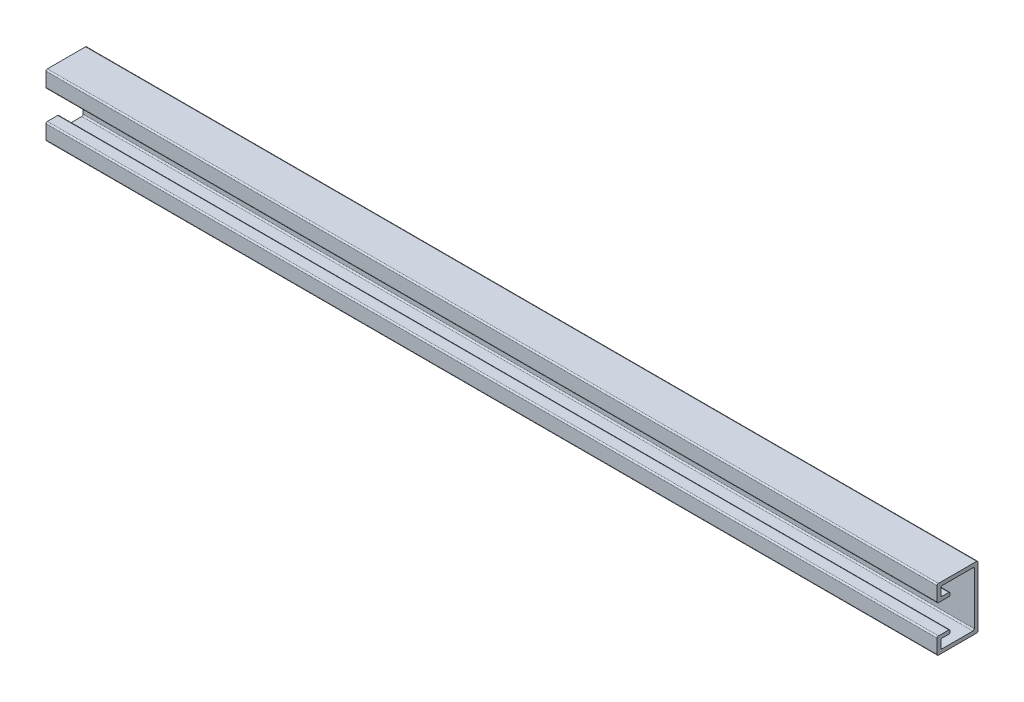
ISO-10303-21;
HEADER;
FILE_DESCRIPTION(('STEP AP214'),'2;1');
FILE_NAME('part.step','',(''),(''),'','','');
FILE_SCHEMA(('AUTOMOTIVE_DESIGN { 1 0 10303 214 1 1 1 1 }'));
ENDSEC;
DATA;
#1=APPLICATION_CONTEXT('core data for automotive mechanical design processes');
#2=APPLICATION_PROTOCOL_DEFINITION('international standard','automotive_design',2000,#1);
#3=PRODUCT_CONTEXT('',#1,'mechanical');
#4=PRODUCT('Part','Part','',(#3));
#5=PRODUCT_RELATED_PRODUCT_CATEGORY('part','',(#4));
#6=PRODUCT_DEFINITION_FORMATION('','',#4);
#7=PRODUCT_DEFINITION_CONTEXT('part definition',#1,'design');
#8=PRODUCT_DEFINITION('design','',#6,#7);
#9=PRODUCT_DEFINITION_SHAPE('','',#8);
#10=(LENGTH_UNIT() NAMED_UNIT(*) SI_UNIT(.MILLI.,.METRE.));
#11=(NAMED_UNIT(*) PLANE_ANGLE_UNIT() SI_UNIT($,.RADIAN.));
#12=(NAMED_UNIT(*) SI_UNIT($,.STERADIAN.) SOLID_ANGLE_UNIT());
#13=UNCERTAINTY_MEASURE_WITH_UNIT(LENGTH_MEASURE(1.E-05),#10,'distance_accuracy_value','');
#14=(GEOMETRIC_REPRESENTATION_CONTEXT(3) GLOBAL_UNCERTAINTY_ASSIGNED_CONTEXT((#13)) GLOBAL_UNIT_ASSIGNED_CONTEXT((#10,
#11,#12)) REPRESENTATION_CONTEXT('',''));
#15=CARTESIAN_POINT('',(0.,0.,0.));
#16=DIRECTION('',(0.,0.,1.));
#17=DIRECTION('',(1.,0.,0.));
#18=AXIS2_PLACEMENT_3D('',#15,#16,#17);
#19=CARTESIAN_POINT('',(1219.2,12.7,45.72));
#20=DIRECTION('',(0.,1.,0.));
#21=DIRECTION('',(0.,0.,1.));
#22=AXIS2_PLACEMENT_3D('',#19,#20,#21);
#23=PLANE('',#22);
#24=DIRECTION('',(0.,0.,-1.));
#25=VECTOR('',#24,1.);
#26=CARTESIAN_POINT('',(1219.2,12.7,45.72));
#27=LINE('',#26,#25);
#28=CARTESIAN_POINT('',(1219.2,12.7,43.815));
#29=VERTEX_POINT('',#28);
#30=CARTESIAN_POINT('',(1219.2,12.7,34.925));
#31=VERTEX_POINT('',#30);
#32=EDGE_CURVE('E315',#29,#31,#27,.T.);
#33=ORIENTED_EDGE('',*,*,#32,.F.);
#34=DIRECTION('',(-1.,0.,0.));
#35=VECTOR('',#34,1.);
#36=CARTESIAN_POINT('',(0.,12.7,43.815));
#37=LINE('',#36,#35);
#38=CARTESIAN_POINT('',(0.,12.7,43.815));
#39=VERTEX_POINT('',#38);
#40=EDGE_CURVE('E299',#29,#39,#37,.T.);
#41=ORIENTED_EDGE('',*,*,#40,.T.);
#42=DIRECTION('',(0.,0.,-1.));
#43=VECTOR('',#42,1.);
#44=CARTESIAN_POINT('',(0.,12.7,45.72));
#45=LINE('',#44,#43);
#46=CARTESIAN_POINT('',(0.,12.7,34.925));
#47=VERTEX_POINT('',#46);
#48=EDGE_CURVE('E312',#39,#47,#45,.T.);
#49=ORIENTED_EDGE('',*,*,#48,.T.);
#50=DIRECTION('',(-1.,0.,0.));
#51=VECTOR('',#50,1.);
#52=CARTESIAN_POINT('',(1219.2,12.7,34.925));
#53=LINE('',#52,#51);
#54=EDGE_CURVE('E318',#47,#31,#53,.F.);
#55=ORIENTED_EDGE('',*,*,#54,.T.);
#56=EDGE_LOOP('',(#33,#41,#49,#55));
#57=FACE_BOUND('',#56,.T.);
#58=ADVANCED_FACE('F15',(#57),#23,.F.);
#59=CARTESIAN_POINT('',(1219.2,17.78,33.02));
#60=DIRECTION('',(0.,0.,-1.));
#61=DIRECTION('',(-1.,0.,0.));
#62=AXIS2_PLACEMENT_3D('',#59,#60,#61);
#63=PLANE('',#62);
#64=DIRECTION('',(0.,-1.,0.));
#65=VECTOR('',#64,1.);
#66=CARTESIAN_POINT('',(1219.2,17.78,33.02));
#67=LINE('',#66,#65);
#68=CARTESIAN_POINT('',(1219.2,15.875,33.02));
#69=VERTEX_POINT('',#68);
#70=CARTESIAN_POINT('',(1219.2,14.605,33.02));
#71=VERTEX_POINT('',#70);
#72=EDGE_CURVE('E646',#69,#71,#67,.T.);
#73=ORIENTED_EDGE('',*,*,#72,.T.);
#74=DIRECTION('',(-1.,0.,0.));
#75=VECTOR('',#74,1.);
#76=CARTESIAN_POINT('',(0.,14.605,33.02));
#77=LINE('',#76,#75);
#78=CARTESIAN_POINT('',(0.,14.605,33.02));
#79=VERTEX_POINT('',#78);
#80=EDGE_CURVE('E520',#71,#79,#77,.T.);
#81=ORIENTED_EDGE('',*,*,#80,.T.);
#82=DIRECTION('',(0.,-1.,0.));
#83=VECTOR('',#82,1.);
#84=CARTESIAN_POINT('',(0.,17.78,33.02));
#85=LINE('',#84,#83);
#86=CARTESIAN_POINT('',(0.,15.875,33.02));
#87=VERTEX_POINT('',#86);
#88=EDGE_CURVE('E325',#87,#79,#85,.T.);
#89=ORIENTED_EDGE('',*,*,#88,.F.);
#90=DIRECTION('',(-1.,0.,0.));
#91=VECTOR('',#90,1.);
#92=CARTESIAN_POINT('',(1219.2,15.875,33.02));
#93=LINE('',#92,#91);
#94=EDGE_CURVE('E517',#87,#69,#93,.F.);
#95=ORIENTED_EDGE('',*,*,#94,.T.);
#96=EDGE_LOOP('',(#73,#81,#89,#95));
#97=FACE_BOUND('',#96,.T.);
#98=ADVANCED_FACE('F662',(#97),#63,.T.);
#99=CARTESIAN_POINT('',(1219.2,17.78,45.72));
#100=DIRECTION('',(0.,1.,0.));
#101=DIRECTION('',(0.,0.,1.));
#102=AXIS2_PLACEMENT_3D('',#99,#100,#101);
#103=PLANE('',#102);
#104=DIRECTION('',(0.,0.,-1.));
#105=VECTOR('',#104,1.);
#106=CARTESIAN_POINT('',(0.,17.78,45.72));
#107=LINE('',#106,#105);
#108=CARTESIAN_POINT('',(0.,17.78,48.895));
#109=VERTEX_POINT('',#108);
#110=CARTESIAN_POINT('',(0.,17.78,34.925));
#111=VERTEX_POINT('',#110);
#112=EDGE_CURVE('E331',#109,#111,#107,.T.);
#113=ORIENTED_EDGE('',*,*,#112,.F.);
#114=DIRECTION('',(-1.,0.,0.));
#115=VECTOR('',#114,1.);
#116=CARTESIAN_POINT('',(1219.2,17.78,48.895));
#117=LINE('',#116,#115);
#118=CARTESIAN_POINT('',(1219.2,17.78,48.895));
#119=VERTEX_POINT('',#118);
#120=EDGE_CURVE('E514',#109,#119,#117,.F.);
#121=ORIENTED_EDGE('',*,*,#120,.T.);
#122=DIRECTION('',(0.,0.,-1.));
#123=VECTOR('',#122,1.);
#124=CARTESIAN_POINT('',(1219.2,17.78,45.72));
#125=LINE('',#124,#123);
#126=CARTESIAN_POINT('',(1219.2,17.78,34.925));
#127=VERTEX_POINT('',#126);
#128=EDGE_CURVE('E642',#119,#127,#125,.T.);
#129=ORIENTED_EDGE('',*,*,#128,.T.);
#130=DIRECTION('',(-1.,0.,0.));
#131=VECTOR('',#130,1.);
#132=CARTESIAN_POINT('',(1219.2,17.78,34.925));
#133=LINE('',#132,#131);
#134=EDGE_CURVE('E510',#127,#111,#133,.T.);
#135=ORIENTED_EDGE('',*,*,#134,.T.);
#136=EDGE_LOOP('',(#113,#121,#129,#135));
#137=FACE_BOUND('',#136,.T.);
#138=ADVANCED_FACE('F670',(#137),#103,.T.);
#139=CARTESIAN_POINT('',(1219.2,0.,50.8));
#140=DIRECTION('',(0.,0.,1.));
#141=DIRECTION('',(0.,-1.,0.));
#142=AXIS2_PLACEMENT_3D('',#139,#140,#141);
#143=PLANE('',#142);
#144=DIRECTION('',(0.,1.,0.));
#145=VECTOR('',#144,1.);
#146=CARTESIAN_POINT('',(0.,0.,50.8));
#147=LINE('',#146,#145);
#148=CARTESIAN_POINT('',(0.,-3.175,50.8));
#149=VERTEX_POINT('',#148);
#150=CARTESIAN_POINT('',(0.,15.875,50.8));
#151=VERTEX_POINT('',#150);
#152=EDGE_CURVE('E340',#149,#151,#147,.T.);
#153=ORIENTED_EDGE('',*,*,#152,.F.);
#154=DIRECTION('',(-1.,0.,0.));
#155=VECTOR('',#154,1.);
#156=CARTESIAN_POINT('',(1219.2,-3.175,50.8));
#157=LINE('',#156,#155);
#158=CARTESIAN_POINT('',(1219.2,-3.175,50.8));
#159=VERTEX_POINT('',#158);
#160=EDGE_CURVE('E480',#149,#159,#157,.F.);
#161=ORIENTED_EDGE('',*,*,#160,.T.);
#162=DIRECTION('',(0.,1.,0.));
#163=VECTOR('',#162,1.);
#164=CARTESIAN_POINT('',(1219.2,0.,50.8));
#165=LINE('',#164,#163);
#166=CARTESIAN_POINT('',(1219.2,15.875,50.8));
#167=VERTEX_POINT('',#166);
#168=EDGE_CURVE('E638',#159,#167,#165,.T.);
#169=ORIENTED_EDGE('',*,*,#168,.T.);
#170=DIRECTION('',(-1.,0.,0.));
#171=VECTOR('',#170,1.);
#172=CARTESIAN_POINT('',(1219.2,15.875,50.8));
#173=LINE('',#172,#171);
#174=EDGE_CURVE('E476',#167,#151,#173,.T.);
#175=ORIENTED_EDGE('',*,*,#174,.T.);
#176=EDGE_LOOP('',(#153,#161,#169,#175));
#177=FACE_BOUND('',#176,.T.);
#178=ADVANCED_FACE('F680',(#177),#143,.T.);
#179=CARTESIAN_POINT('',(1219.2,-5.08,0.));
#180=DIRECTION('',(0.,-1.,0.));
#181=DIRECTION('',(0.,0.,-1.));
#182=AXIS2_PLACEMENT_3D('',#179,#180,#181);
#183=PLANE('',#182);
#184=DIRECTION('',(0.,0.,-1.));
#185=VECTOR('',#184,1.);
#186=CARTESIAN_POINT('',(1219.2,-5.08,0.));
#187=LINE('',#186,#185);
#188=CARTESIAN_POINT('',(1219.2,-5.08,-3.175));
#189=VERTEX_POINT('',#188);
#190=CARTESIAN_POINT('',(1219.2,-5.08,48.895));
#191=VERTEX_POINT('',#190);
#192=EDGE_CURVE('E634',#189,#191,#187,.F.);
#193=ORIENTED_EDGE('',*,*,#192,.T.);
#194=DIRECTION('',(-1.,0.,0.));
#195=VECTOR('',#194,1.);
#196=CARTESIAN_POINT('',(1219.2,-5.08,48.895));
#197=LINE('',#196,#195);
#198=CARTESIAN_POINT('',(0.,-5.08,48.895));
#199=VERTEX_POINT('',#198);
#200=EDGE_CURVE('E472',#191,#199,#197,.T.);
#201=ORIENTED_EDGE('',*,*,#200,.T.);
#202=DIRECTION('',(0.,0.,-1.));
#203=VECTOR('',#202,1.);
#204=CARTESIAN_POINT('',(0.,-5.08,0.));
#205=LINE('',#204,#203);
#206=CARTESIAN_POINT('',(0.,-5.08,-3.175));
#207=VERTEX_POINT('',#206);
#208=EDGE_CURVE('E344',#207,#199,#205,.F.);
#209=ORIENTED_EDGE('',*,*,#208,.F.);
#210=DIRECTION('',(-1.,0.,0.));
#211=VECTOR('',#210,1.);
#212=CARTESIAN_POINT('',(1219.2,-5.08,-3.175));
#213=LINE('',#212,#211);
#214=EDGE_CURVE('E469',#207,#189,#213,.F.);
#215=ORIENTED_EDGE('',*,*,#214,.T.);
#216=EDGE_LOOP('',(#193,#201,#209,#215));
#217=FACE_BOUND('',#216,.T.);
#218=ADVANCED_FACE('F688',(#217),#183,.T.);
#219=CARTESIAN_POINT('',(1219.2,0.,-5.08));
#220=DIRECTION('',(0.,0.,-1.));
#221=DIRECTION('',(-1.,0.,0.));
#222=AXIS2_PLACEMENT_3D('',#219,#220,#221);
#223=PLANE('',#222);
#224=DIRECTION('',(0.,1.,0.));
#225=VECTOR('',#224,1.);
#226=CARTESIAN_POINT('',(1219.2,0.,-5.08));
#227=LINE('',#226,#225);
#228=CARTESIAN_POINT('',(1219.2,78.105,-5.08));
#229=VERTEX_POINT('',#228);
#230=CARTESIAN_POINT('',(1219.2,-3.175,-5.08));
#231=VERTEX_POINT('',#230);
#232=EDGE_CURVE('E630',#229,#231,#227,.F.);
#233=ORIENTED_EDGE('',*,*,#232,.T.);
#234=DIRECTION('',(-1.,0.,0.));
#235=VECTOR('',#234,1.);
#236=CARTESIAN_POINT('',(1219.2,-3.175,-5.08));
#237=LINE('',#236,#235);
#238=CARTESIAN_POINT('',(0.,-3.175,-5.08));
#239=VERTEX_POINT('',#238);
#240=EDGE_CURVE('E499',#231,#239,#237,.T.);
#241=ORIENTED_EDGE('',*,*,#240,.T.);
#242=DIRECTION('',(0.,1.,0.));
#243=VECTOR('',#242,1.);
#244=CARTESIAN_POINT('',(0.,0.,-5.08));
#245=LINE('',#244,#243);
#246=CARTESIAN_POINT('',(0.,78.105,-5.08));
#247=VERTEX_POINT('',#246);
#248=EDGE_CURVE('E348',#247,#239,#245,.F.);
#249=ORIENTED_EDGE('',*,*,#248,.F.);
#250=DIRECTION('',(-1.,0.,0.));
#251=VECTOR('',#250,1.);
#252=CARTESIAN_POINT('',(1219.2,78.105,-5.08));
#253=LINE('',#252,#251);
#254=EDGE_CURVE('E496',#247,#229,#253,.F.);
#255=ORIENTED_EDGE('',*,*,#254,.T.);
#256=EDGE_LOOP('',(#233,#241,#249,#255));
#257=FACE_BOUND('',#256,.T.);
#258=ADVANCED_FACE('F698',(#257),#223,.T.);
#259=CARTESIAN_POINT('',(1219.2,80.01,0.));
#260=DIRECTION('',(0.,1.,0.));
#261=DIRECTION('',(0.,0.,1.));
#262=AXIS2_PLACEMENT_3D('',#259,#260,#261);
#263=PLANE('',#262);
#264=DIRECTION('',(0.,0.,-1.));
#265=VECTOR('',#264,1.);
#266=CARTESIAN_POINT('',(0.,80.01,0.));
#267=LINE('',#266,#265);
#268=CARTESIAN_POINT('',(0.,80.01,48.895));
#269=VERTEX_POINT('',#268);
#270=CARTESIAN_POINT('',(0.,80.01,-3.175));
#271=VERTEX_POINT('',#270);
#272=EDGE_CURVE('E352',#269,#271,#267,.T.);
#273=ORIENTED_EDGE('',*,*,#272,.F.);
#274=DIRECTION('',(-1.,0.,0.));
#275=VECTOR('',#274,1.);
#276=CARTESIAN_POINT('',(1219.2,80.01,48.895));
#277=LINE('',#276,#275);
#278=CARTESIAN_POINT('',(1219.2,80.01,48.895));
#279=VERTEX_POINT('',#278);
#280=EDGE_CURVE('E507',#269,#279,#277,.F.);
#281=ORIENTED_EDGE('',*,*,#280,.T.);
#282=DIRECTION('',(0.,0.,-1.));
#283=VECTOR('',#282,1.);
#284=CARTESIAN_POINT('',(1219.2,80.01,0.));
#285=LINE('',#284,#283);
#286=CARTESIAN_POINT('',(1219.2,80.01,-3.175));
#287=VERTEX_POINT('',#286);
#288=EDGE_CURVE('E626',#279,#287,#285,.T.);
#289=ORIENTED_EDGE('',*,*,#288,.T.);
#290=DIRECTION('',(-1.,0.,0.));
#291=VECTOR('',#290,1.);
#292=CARTESIAN_POINT('',(1219.2,80.01,-3.175));
#293=LINE('',#292,#291);
#294=EDGE_CURVE('E503',#287,#271,#293,.T.);
#295=ORIENTED_EDGE('',*,*,#294,.T.);
#296=EDGE_LOOP('',(#273,#281,#289,#295));
#297=FACE_BOUND('',#296,.T.);
#298=ADVANCED_FACE('F706',(#297),#263,.T.);
#299=CARTESIAN_POINT('',(1219.2,74.93,50.8));
#300=DIRECTION('',(0.,0.,1.));
#301=DIRECTION('',(1.,0.,0.));
#302=AXIS2_PLACEMENT_3D('',#299,#300,#301);
#303=PLANE('',#302);
#304=DIRECTION('',(0.,1.,0.));
#305=VECTOR('',#304,1.);
#306=CARTESIAN_POINT('',(0.,74.93,50.8));
#307=LINE('',#306,#305);
#308=CARTESIAN_POINT('',(0.,59.055,50.8));
#309=VERTEX_POINT('',#308);
#310=CARTESIAN_POINT('',(0.,78.105,50.8));
#311=VERTEX_POINT('',#310);
#312=EDGE_CURVE('E356',#309,#311,#307,.T.);
#313=ORIENTED_EDGE('',*,*,#312,.F.);
#314=DIRECTION('',(-1.,0.,0.));
#315=VECTOR('',#314,1.);
#316=CARTESIAN_POINT('',(1219.2,59.055,50.8));
#317=LINE('',#316,#315);
#318=CARTESIAN_POINT('',(1219.2,59.055,50.8));
#319=VERTEX_POINT('',#318);
#320=EDGE_CURVE('E436',#309,#319,#317,.F.);
#321=ORIENTED_EDGE('',*,*,#320,.T.);
#322=DIRECTION('',(0.,1.,0.));
#323=VECTOR('',#322,1.);
#324=CARTESIAN_POINT('',(1219.2,74.93,50.8));
#325=LINE('',#324,#323);
#326=CARTESIAN_POINT('',(1219.2,78.105,50.8));
#327=VERTEX_POINT('',#326);
#328=EDGE_CURVE('E622',#319,#327,#325,.T.);
#329=ORIENTED_EDGE('',*,*,#328,.T.);
#330=DIRECTION('',(-1.,0.,0.));
#331=VECTOR('',#330,1.);
#332=CARTESIAN_POINT('',(1219.2,78.105,50.8));
#333=LINE('',#332,#331);
#334=EDGE_CURVE('E432',#327,#311,#333,.T.);
#335=ORIENTED_EDGE('',*,*,#334,.T.);
#336=EDGE_LOOP('',(#313,#321,#329,#335));
#337=FACE_BOUND('',#336,.T.);
#338=ADVANCED_FACE('F715',(#337),#303,.T.);
#339=CARTESIAN_POINT('',(1219.2,57.15,45.72));
#340=DIRECTION('',(0.,-1.,0.));
#341=DIRECTION('',(0.,0.,-1.));
#342=AXIS2_PLACEMENT_3D('',#339,#340,#341);
#343=PLANE('',#342);
#344=DIRECTION('',(0.,0.,1.));
#345=VECTOR('',#344,1.);
#346=CARTESIAN_POINT('',(1219.2,57.15,45.72));
#347=LINE('',#346,#345);
#348=CARTESIAN_POINT('',(1219.2,57.15,34.925));
#349=VERTEX_POINT('',#348);
#350=CARTESIAN_POINT('',(1219.2,57.15,48.895));
#351=VERTEX_POINT('',#350);
#352=EDGE_CURVE('E618',#349,#351,#347,.T.);
#353=ORIENTED_EDGE('',*,*,#352,.T.);
#354=DIRECTION('',(-1.,0.,0.));
#355=VECTOR('',#354,1.);
#356=CARTESIAN_POINT('',(1219.2,57.15,48.895));
#357=LINE('',#356,#355);
#358=CARTESIAN_POINT('',(0.,57.15,48.895));
#359=VERTEX_POINT('',#358);
#360=EDGE_CURVE('E399',#351,#359,#357,.T.);
#361=ORIENTED_EDGE('',*,*,#360,.T.);
#362=DIRECTION('',(0.,0.,1.));
#363=VECTOR('',#362,1.);
#364=CARTESIAN_POINT('',(0.,57.15,45.72));
#365=LINE('',#364,#363);
#366=CARTESIAN_POINT('',(0.,57.15,34.925));
#367=VERTEX_POINT('',#366);
#368=EDGE_CURVE('E360',#367,#359,#365,.T.);
#369=ORIENTED_EDGE('',*,*,#368,.F.);
#370=DIRECTION('',(-1.,0.,0.));
#371=VECTOR('',#370,1.);
#372=CARTESIAN_POINT('',(1219.2,57.15,34.925));
#373=LINE('',#372,#371);
#374=EDGE_CURVE('E396',#367,#349,#373,.F.);
#375=ORIENTED_EDGE('',*,*,#374,.T.);
#376=EDGE_LOOP('',(#353,#361,#369,#375));
#377=FACE_BOUND('',#376,.T.);
#378=ADVANCED_FACE('F723',(#377),#343,.T.);
#379=CARTESIAN_POINT('',(1219.2,62.23,33.02));
#380=DIRECTION('',(0.,0.,-1.));
#381=DIRECTION('',(-1.,0.,0.));
#382=AXIS2_PLACEMENT_3D('',#379,#380,#381);
#383=PLANE('',#382);
#384=DIRECTION('',(0.,-1.,0.));
#385=VECTOR('',#384,1.);
#386=CARTESIAN_POINT('',(1219.2,62.23,33.02));
#387=LINE('',#386,#385);
#388=CARTESIAN_POINT('',(1219.2,60.325,33.02));
#389=VERTEX_POINT('',#388);
#390=CARTESIAN_POINT('',(1219.2,59.055,33.02));
#391=VERTEX_POINT('',#390);
#392=EDGE_CURVE('E614',#389,#391,#387,.T.);
#393=ORIENTED_EDGE('',*,*,#392,.T.);
#394=DIRECTION('',(-1.,0.,0.));
#395=VECTOR('',#394,1.);
#396=CARTESIAN_POINT('',(1219.2,59.055,33.02));
#397=LINE('',#396,#395);
#398=CARTESIAN_POINT('',(0.,59.055,33.02));
#399=VERTEX_POINT('',#398);
#400=EDGE_CURVE('E527',#391,#399,#397,.T.);
#401=ORIENTED_EDGE('',*,*,#400,.T.);
#402=DIRECTION('',(0.,-1.,0.));
#403=VECTOR('',#402,1.);
#404=CARTESIAN_POINT('',(0.,62.23,33.02));
#405=LINE('',#404,#403);
#406=CARTESIAN_POINT('',(0.,60.325,33.02));
#407=VERTEX_POINT('',#406);
#408=EDGE_CURVE('E363',#407,#399,#405,.T.);
#409=ORIENTED_EDGE('',*,*,#408,.F.);
#410=DIRECTION('',(-1.,0.,0.));
#411=VECTOR('',#410,1.);
#412=CARTESIAN_POINT('',(1219.2,60.325,33.02));
#413=LINE('',#412,#411);
#414=EDGE_CURVE('E524',#407,#389,#413,.F.);
#415=ORIENTED_EDGE('',*,*,#414,.T.);
#416=EDGE_LOOP('',(#393,#401,#409,#415));
#417=FACE_BOUND('',#416,.T.);
#418=ADVANCED_FACE('F733',(#417),#383,.T.);
#419=CARTESIAN_POINT('',(1219.2,62.23,45.72));
#420=DIRECTION('',(0.,-1.,0.));
#421=DIRECTION('',(0.,0.,-1.));
#422=AXIS2_PLACEMENT_3D('',#419,#420,#421);
#423=PLANE('',#422);
#424=DIRECTION('',(0.,0.,1.));
#425=VECTOR('',#424,1.);
#426=CARTESIAN_POINT('',(1219.2,62.23,45.72));
#427=LINE('',#426,#425);
#428=CARTESIAN_POINT('',(1219.2,62.23,34.925));
#429=VERTEX_POINT('',#428);
#430=CARTESIAN_POINT('',(1219.2,62.23,43.815));
#431=VERTEX_POINT('',#430);
#432=EDGE_CURVE('E610',#429,#431,#427,.T.);
#433=ORIENTED_EDGE('',*,*,#432,.F.);
#434=DIRECTION('',(-1.,0.,0.));
#435=VECTOR('',#434,1.);
#436=CARTESIAN_POINT('',(0.,62.23,34.925));
#437=LINE('',#436,#435);
#438=CARTESIAN_POINT('',(0.,62.23,34.925));
#439=VERTEX_POINT('',#438);
#440=EDGE_CURVE('E534',#429,#439,#437,.T.);
#441=ORIENTED_EDGE('',*,*,#440,.T.);
#442=DIRECTION('',(0.,0.,1.));
#443=VECTOR('',#442,1.);
#444=CARTESIAN_POINT('',(0.,62.23,45.72));
#445=LINE('',#444,#443);
#446=CARTESIAN_POINT('',(0.,62.23,43.815));
#447=VERTEX_POINT('',#446);
#448=EDGE_CURVE('E367',#439,#447,#445,.T.);
#449=ORIENTED_EDGE('',*,*,#448,.T.);
#450=DIRECTION('',(-1.,0.,0.));
#451=VECTOR('',#450,1.);
#452=CARTESIAN_POINT('',(1219.2,62.23,43.815));
#453=LINE('',#452,#451);
#454=EDGE_CURVE('E531',#447,#431,#453,.F.);
#455=ORIENTED_EDGE('',*,*,#454,.T.);
#456=EDGE_LOOP('',(#433,#441,#449,#455));
#457=FACE_BOUND('',#456,.T.);
#458=ADVANCED_FACE('F742',(#457),#423,.F.);
#459=CARTESIAN_POINT('',(1219.2,74.93,45.72));
#460=DIRECTION('',(0.,0.,1.));
#461=DIRECTION('',(1.,0.,0.));
#462=AXIS2_PLACEMENT_3D('',#459,#460,#461);
#463=PLANE('',#462);
#464=DIRECTION('',(0.,1.,0.));
#465=VECTOR('',#464,1.);
#466=CARTESIAN_POINT('',(1219.2,74.93,45.72));
#467=LINE('',#466,#465);
#468=CARTESIAN_POINT('',(1219.2,64.135,45.72));
#469=VERTEX_POINT('',#468);
#470=CARTESIAN_POINT('',(1219.2,73.025,45.72));
#471=VERTEX_POINT('',#470);
#472=EDGE_CURVE('E604',#469,#471,#467,.T.);
#473=ORIENTED_EDGE('',*,*,#472,.F.);
#474=DIRECTION('',(-1.,0.,0.));
#475=VECTOR('',#474,1.);
#476=CARTESIAN_POINT('',(0.,64.135,45.72));
#477=LINE('',#476,#475);
#478=CARTESIAN_POINT('',(0.,64.135,45.72));
#479=VERTEX_POINT('',#478);
#480=EDGE_CURVE('E541',#469,#479,#477,.T.);
#481=ORIENTED_EDGE('',*,*,#480,.T.);
#482=DIRECTION('',(0.,1.,0.));
#483=VECTOR('',#482,1.);
#484=CARTESIAN_POINT('',(0.,74.93,45.72));
#485=LINE('',#484,#483);
#486=CARTESIAN_POINT('',(0.,73.025,45.72));
#487=VERTEX_POINT('',#486);
#488=EDGE_CURVE('E371',#479,#487,#485,.T.);
#489=ORIENTED_EDGE('',*,*,#488,.T.);
#490=DIRECTION('',(-1.,0.,0.));
#491=VECTOR('',#490,1.);
#492=CARTESIAN_POINT('',(1219.2,73.025,45.72));
#493=LINE('',#492,#491);
#494=EDGE_CURVE('E538',#487,#471,#493,.F.);
#495=ORIENTED_EDGE('',*,*,#494,.T.);
#496=EDGE_LOOP('',(#473,#481,#489,#495));
#497=FACE_BOUND('',#496,.T.);
#498=ADVANCED_FACE('F751',(#497),#463,.F.);
#499=CARTESIAN_POINT('',(1219.2,74.93,0.));
#500=DIRECTION('',(0.,1.,0.));
#501=DIRECTION('',(0.,0.,1.));
#502=AXIS2_PLACEMENT_3D('',#499,#500,#501);
#503=PLANE('',#502);
#504=DIRECTION('',(0.,0.,-1.));
#505=VECTOR('',#504,1.);
#506=CARTESIAN_POINT('',(1219.2,74.93,0.));
#507=LINE('',#506,#505);
#508=CARTESIAN_POINT('',(1219.2,74.93,43.815));
#509=VERTEX_POINT('',#508);
#510=CARTESIAN_POINT('',(1219.2,74.93,1.905));
#511=VERTEX_POINT('',#510);
#512=EDGE_CURVE('E594',#509,#511,#507,.T.);
#513=ORIENTED_EDGE('',*,*,#512,.F.);
#514=DIRECTION('',(-1.,0.,0.));
#515=VECTOR('',#514,1.);
#516=CARTESIAN_POINT('',(0.,74.93,43.815));
#517=LINE('',#516,#515);
#518=CARTESIAN_POINT('',(0.,74.93,43.815));
#519=VERTEX_POINT('',#518);
#520=EDGE_CURVE('E307',#509,#519,#517,.T.);
#521=ORIENTED_EDGE('',*,*,#520,.T.);
#522=DIRECTION('',(0.,0.,-1.));
#523=VECTOR('',#522,1.);
#524=CARTESIAN_POINT('',(0.,74.93,0.));
#525=LINE('',#524,#523);
#526=CARTESIAN_POINT('',(0.,74.93,1.905));
#527=VERTEX_POINT('',#526);
#528=EDGE_CURVE('E375',#519,#527,#525,.T.);
#529=ORIENTED_EDGE('',*,*,#528,.T.);
#530=DIRECTION('',(-1.,0.,0.));
#531=VECTOR('',#530,1.);
#532=CARTESIAN_POINT('',(1219.2,74.93,1.905));
#533=LINE('',#532,#531);
#534=EDGE_CURVE('E545',#527,#511,#533,.F.);
#535=ORIENTED_EDGE('',*,*,#534,.T.);
#536=EDGE_LOOP('',(#513,#521,#529,#535));
#537=FACE_BOUND('',#536,.T.);
#538=ADVANCED_FACE('F586',(#537),#503,.F.);
#539=CARTESIAN_POINT('',(1219.2,0.,0.));
#540=DIRECTION('',(0.,0.,-1.));
#541=DIRECTION('',(-1.,0.,0.));
#542=AXIS2_PLACEMENT_3D('',#539,#540,#541);
#543=PLANE('',#542);
#544=DIRECTION('',(0.,-1.,0.));
#545=VECTOR('',#544,1.);
#546=CARTESIAN_POINT('',(0.,0.,0.));
#547=LINE('',#546,#545);
#548=CARTESIAN_POINT('',(0.,73.025,0.));
#549=VERTEX_POINT('',#548);
#550=CARTESIAN_POINT('',(0.,1.905,0.));
#551=VERTEX_POINT('',#550);
#552=EDGE_CURVE('E379',#549,#551,#547,.T.);
#553=ORIENTED_EDGE('',*,*,#552,.T.);
#554=DIRECTION('',(-1.,0.,0.));
#555=VECTOR('',#554,1.);
#556=CARTESIAN_POINT('',(1219.2,1.905,0.));
#557=LINE('',#556,#555);
#558=CARTESIAN_POINT('',(1219.2,1.905,0.));
#559=VERTEX_POINT('',#558);
#560=EDGE_CURVE('E493',#551,#559,#557,.F.);
#561=ORIENTED_EDGE('',*,*,#560,.T.);
#562=DIRECTION('',(0.,-1.,0.));
#563=VECTOR('',#562,1.);
#564=CARTESIAN_POINT('',(1219.2,0.,0.));
#565=LINE('',#564,#563);
#566=CARTESIAN_POINT('',(1219.2,73.025,0.));
#567=VERTEX_POINT('',#566);
#568=EDGE_CURVE('E593',#567,#559,#565,.T.);
#569=ORIENTED_EDGE('',*,*,#568,.F.);
#570=DIRECTION('',(-1.,0.,0.));
#571=VECTOR('',#570,1.);
#572=CARTESIAN_POINT('',(0.,73.025,0.));
#573=LINE('',#572,#571);
#574=EDGE_CURVE('E489',#567,#549,#573,.T.);
#575=ORIENTED_EDGE('',*,*,#574,.T.);
#576=EDGE_LOOP('',(#553,#561,#569,#575));
#577=FACE_BOUND('',#576,.T.);
#578=ADVANCED_FACE('F596',(#577),#543,.F.);
#579=CARTESIAN_POINT('',(1219.2,0.,0.));
#580=DIRECTION('',(0.,-1.,0.));
#581=DIRECTION('',(0.,0.,-1.));
#582=AXIS2_PLACEMENT_3D('',#579,#580,#581);
#583=PLANE('',#582);
#584=DIRECTION('',(0.,0.,1.));
#585=VECTOR('',#584,1.);
#586=CARTESIAN_POINT('',(1219.2,0.,0.));
#587=LINE('',#586,#585);
#588=CARTESIAN_POINT('',(1219.2,0.,1.905));
#589=VERTEX_POINT('',#588);
#590=CARTESIAN_POINT('',(1219.2,0.,43.815));
#591=VERTEX_POINT('',#590);
#592=EDGE_CURVE('E598',#589,#591,#587,.T.);
#593=ORIENTED_EDGE('',*,*,#592,.F.);
#594=DIRECTION('',(-1.,0.,0.));
#595=VECTOR('',#594,1.);
#596=CARTESIAN_POINT('',(0.,0.,1.905));
#597=LINE('',#596,#595);
#598=CARTESIAN_POINT('',(0.,0.,1.905));
#599=VERTEX_POINT('',#598);
#600=EDGE_CURVE('E485',#589,#599,#597,.T.);
#601=ORIENTED_EDGE('',*,*,#600,.T.);
#602=DIRECTION('',(0.,0.,1.));
#603=VECTOR('',#602,1.);
#604=CARTESIAN_POINT('',(0.,0.,0.));
#605=LINE('',#604,#603);
#606=CARTESIAN_POINT('',(0.,0.,43.815));
#607=VERTEX_POINT('',#606);
#608=EDGE_CURVE('E383',#599,#607,#605,.T.);
#609=ORIENTED_EDGE('',*,*,#608,.T.);
#610=DIRECTION('',(-1.,0.,0.));
#611=VECTOR('',#610,1.);
#612=CARTESIAN_POINT('',(1219.2,0.,43.815));
#613=LINE('',#612,#611);
#614=EDGE_CURVE('E36',#607,#591,#613,.F.);
#615=ORIENTED_EDGE('',*,*,#614,.T.);
#616=EDGE_LOOP('',(#593,#601,#609,#615));
#617=FACE_BOUND('',#616,.T.);
#618=ADVANCED_FACE('F864',(#617),#583,.F.);
#619=CARTESIAN_POINT('',(1219.2,0.,45.72));
#620=DIRECTION('',(0.,0.,1.));
#621=DIRECTION('',(0.,-1.,0.));
#622=AXIS2_PLACEMENT_3D('',#619,#620,#621);
#623=PLANE('',#622);
#624=DIRECTION('',(0.,1.,0.));
#625=VECTOR('',#624,1.);
#626=CARTESIAN_POINT('',(0.,0.,45.72));
#627=LINE('',#626,#625);
#628=CARTESIAN_POINT('',(0.,1.905,45.72));
#629=VERTEX_POINT('',#628);
#630=CARTESIAN_POINT('',(0.,10.795,45.72));
#631=VERTEX_POINT('',#630);
#632=EDGE_CURVE('E386',#629,#631,#627,.T.);
#633=ORIENTED_EDGE('',*,*,#632,.T.);
#634=DIRECTION('',(-1.,0.,0.));
#635=VECTOR('',#634,1.);
#636=CARTESIAN_POINT('',(1219.2,10.795,45.72));
#637=LINE('',#636,#635);
#638=CARTESIAN_POINT('',(1219.2,10.795,45.72));
#639=VERTEX_POINT('',#638);
#640=EDGE_CURVE('E300',#631,#639,#637,.F.);
#641=ORIENTED_EDGE('',*,*,#640,.T.);
#642=DIRECTION('',(0.,1.,0.));
#643=VECTOR('',#642,1.);
#644=CARTESIAN_POINT('',(1219.2,0.,45.72));
#645=LINE('',#644,#643);
#646=CARTESIAN_POINT('',(1219.2,1.905,45.72));
#647=VERTEX_POINT('',#646);
#648=EDGE_CURVE('E334',#647,#639,#645,.T.);
#649=ORIENTED_EDGE('',*,*,#648,.F.);
#650=DIRECTION('',(-1.,0.,0.));
#651=VECTOR('',#650,1.);
#652=CARTESIAN_POINT('',(0.,1.905,45.72));
#653=LINE('',#652,#651);
#654=EDGE_CURVE('E317',#647,#629,#653,.T.);
#655=ORIENTED_EDGE('',*,*,#654,.T.);
#656=EDGE_LOOP('',(#633,#641,#649,#655));
#657=FACE_BOUND('',#656,.T.);
#658=ADVANCED_FACE('F873',(#657),#623,.F.);
#659=CARTESIAN_POINT('',(1219.2,0.,0.));
#660=DIRECTION('',(-1.,0.,0.));
#661=DIRECTION('',(0.,0.,1.));
#662=AXIS2_PLACEMENT_3D('',#659,#660,#661);
#663=PLANE('',#662);
#664=ORIENTED_EDGE('',*,*,#328,.F.);
#665=CARTESIAN_POINT('',(1219.2,59.055,48.895));
#666=DIRECTION('',(-1.,0.,0.));
#667=DIRECTION('',(0.,0.,1.));
#668=AXIS2_PLACEMENT_3D('',#665,#666,#667);
#669=CIRCLE('',#668,1.905);
#670=EDGE_CURVE('E466',#319,#351,#669,.F.);
#671=ORIENTED_EDGE('',*,*,#670,.T.);
#672=ORIENTED_EDGE('',*,*,#352,.F.);
#673=CARTESIAN_POINT('',(1219.2,59.055,34.925));
#674=DIRECTION('',(-1.,0.,0.));
#675=DIRECTION('',(0.,0.,1.));
#676=AXIS2_PLACEMENT_3D('',#673,#674,#675);
#677=CIRCLE('',#676,1.905);
#678=EDGE_CURVE('E442',#349,#391,#677,.F.);
#679=ORIENTED_EDGE('',*,*,#678,.T.);
#680=ORIENTED_EDGE('',*,*,#392,.F.);
#681=CARTESIAN_POINT('',(1219.2,60.325,34.925));
#682=DIRECTION('',(-1.,0.,0.));
#683=DIRECTION('',(0.,0.,1.));
#684=AXIS2_PLACEMENT_3D('',#681,#682,#683);
#685=CIRCLE('',#684,1.905);
#686=EDGE_CURVE('E439',#389,#429,#685,.F.);
#687=ORIENTED_EDGE('',*,*,#686,.T.);
#688=ORIENTED_EDGE('',*,*,#432,.T.);
#689=CARTESIAN_POINT('',(1219.2,64.135,43.815));
#690=DIRECTION('',(-1.,0.,0.));
#691=DIRECTION('',(0.,0.,1.));
#692=AXIS2_PLACEMENT_3D('',#689,#690,#691);
#693=CIRCLE('',#692,1.905);
#694=EDGE_CURVE('E567',#431,#469,#693,.T.);
#695=ORIENTED_EDGE('',*,*,#694,.T.);
#696=ORIENTED_EDGE('',*,*,#472,.T.);
#697=CARTESIAN_POINT('',(1219.2,73.025,43.815));
#698=DIRECTION('',(-1.,0.,0.));
#699=DIRECTION('',(0.,0.,1.));
#700=AXIS2_PLACEMENT_3D('',#697,#698,#699);
#701=CIRCLE('',#700,1.905);
#702=EDGE_CURVE('E573',#471,#509,#701,.T.);
#703=ORIENTED_EDGE('',*,*,#702,.T.);
#704=ORIENTED_EDGE('',*,*,#512,.T.);
#705=CARTESIAN_POINT('',(1219.2,73.025,1.905));
#706=DIRECTION('',(-1.,0.,0.));
#707=DIRECTION('',(0.,0.,1.));
#708=AXIS2_PLACEMENT_3D('',#705,#706,#707);
#709=CIRCLE('',#708,1.905);
#710=EDGE_CURVE('E10',#511,#567,#709,.T.);
#711=ORIENTED_EDGE('',*,*,#710,.T.);
#712=ORIENTED_EDGE('',*,*,#568,.T.);
#713=CARTESIAN_POINT('',(1219.2,1.905,1.905));
#714=DIRECTION('',(-1.,0.,0.));
#715=DIRECTION('',(0.,0.,1.));
#716=AXIS2_PLACEMENT_3D('',#713,#714,#715);
#717=CIRCLE('',#716,1.905);
#718=EDGE_CURVE('E45',#559,#589,#717,.T.);
#719=ORIENTED_EDGE('',*,*,#718,.T.);
#720=ORIENTED_EDGE('',*,*,#592,.T.);
#721=CARTESIAN_POINT('',(1219.2,1.905,43.815));
#722=DIRECTION('',(-1.,0.,0.));
#723=DIRECTION('',(0.,0.,1.));
#724=AXIS2_PLACEMENT_3D('',#721,#722,#723);
#725=CIRCLE('',#724,1.905);
#726=EDGE_CURVE('E561',#591,#647,#725,.T.);
#727=ORIENTED_EDGE('',*,*,#726,.T.);
#728=ORIENTED_EDGE('',*,*,#648,.T.);
#729=CARTESIAN_POINT('',(1219.2,10.795,43.815));
#730=DIRECTION('',(-1.,0.,0.));
#731=DIRECTION('',(0.,0.,1.));
#732=AXIS2_PLACEMENT_3D('',#729,#730,#731);
#733=CIRCLE('',#732,1.905);
#734=EDGE_CURVE('E306',#639,#29,#733,.T.);
#735=ORIENTED_EDGE('',*,*,#734,.T.);
#736=ORIENTED_EDGE('',*,*,#32,.T.);
#737=CARTESIAN_POINT('',(1219.2,14.605,34.925));
#738=DIRECTION('',(-1.,0.,0.));
#739=DIRECTION('',(0.,0.,1.));
#740=AXIS2_PLACEMENT_3D('',#737,#738,#739);
#741=CIRCLE('',#740,1.905);
#742=EDGE_CURVE('E448',#31,#71,#741,.F.);
#743=ORIENTED_EDGE('',*,*,#742,.T.);
#744=ORIENTED_EDGE('',*,*,#72,.F.);
#745=CARTESIAN_POINT('',(1219.2,15.875,34.925));
#746=DIRECTION('',(-1.,0.,0.));
#747=DIRECTION('',(0.,0.,1.));
#748=AXIS2_PLACEMENT_3D('',#745,#746,#747);
#749=CIRCLE('',#748,1.905);
#750=EDGE_CURVE('E445',#69,#127,#749,.F.);
#751=ORIENTED_EDGE('',*,*,#750,.T.);
#752=ORIENTED_EDGE('',*,*,#128,.F.);
#753=CARTESIAN_POINT('',(1219.2,15.875,48.895));
#754=DIRECTION('',(-1.,0.,0.));
#755=DIRECTION('',(0.,0.,1.));
#756=AXIS2_PLACEMENT_3D('',#753,#754,#755);
#757=CIRCLE('',#756,1.905);
#758=EDGE_CURVE('E451',#119,#167,#757,.F.);
#759=ORIENTED_EDGE('',*,*,#758,.T.);
#760=ORIENTED_EDGE('',*,*,#168,.F.);
#761=CARTESIAN_POINT('',(1219.2,-3.175,48.895));
#762=DIRECTION('',(-1.,0.,0.));
#763=DIRECTION('',(0.,0.,1.));
#764=AXIS2_PLACEMENT_3D('',#761,#762,#763);
#765=CIRCLE('',#764,1.905);
#766=EDGE_CURVE('E463',#159,#191,#765,.F.);
#767=ORIENTED_EDGE('',*,*,#766,.T.);
#768=ORIENTED_EDGE('',*,*,#192,.F.);
#769=CARTESIAN_POINT('',(1219.2,-3.175,-3.175));
#770=DIRECTION('',(-1.,0.,0.));
#771=DIRECTION('',(0.,0.,1.));
#772=AXIS2_PLACEMENT_3D('',#769,#770,#771);
#773=CIRCLE('',#772,1.905);
#774=EDGE_CURVE('E460',#189,#231,#773,.F.);
#775=ORIENTED_EDGE('',*,*,#774,.T.);
#776=ORIENTED_EDGE('',*,*,#232,.F.);
#777=CARTESIAN_POINT('',(1219.2,78.105,-3.175));
#778=DIRECTION('',(-1.,0.,0.));
#779=DIRECTION('',(0.,0.,1.));
#780=AXIS2_PLACEMENT_3D('',#777,#778,#779);
#781=CIRCLE('',#780,1.905);
#782=EDGE_CURVE('E454',#229,#287,#781,.F.);
#783=ORIENTED_EDGE('',*,*,#782,.T.);
#784=ORIENTED_EDGE('',*,*,#288,.F.);
#785=CARTESIAN_POINT('',(1219.2,78.105,48.895));
#786=DIRECTION('',(-1.,0.,0.));
#787=DIRECTION('',(0.,0.,1.));
#788=AXIS2_PLACEMENT_3D('',#785,#786,#787);
#789=CIRCLE('',#788,1.905);
#790=EDGE_CURVE('E457',#279,#327,#789,.F.);
#791=ORIENTED_EDGE('',*,*,#790,.T.);
#792=EDGE_LOOP('',(#664,#671,#672,#679,#680,#687,#688,#695,#696,#703,#704,#711,#712,#719,#720,
#727,#728,#735,#736,#743,#744,#751,#752,#759,#760,#767,#768,#775,#776,#783,#784,#791));
#793=FACE_BOUND('',#792,.T.);
#794=ADVANCED_FACE('F592',(#793),#663,.F.);
#795=CARTESIAN_POINT('',(0.,0.,0.));
#796=DIRECTION('',(-1.,0.,0.));
#797=DIRECTION('',(0.,0.,1.));
#798=AXIS2_PLACEMENT_3D('',#795,#796,#797);
#799=PLANE('',#798);
#800=ORIENTED_EDGE('',*,*,#368,.T.);
#801=CARTESIAN_POINT('',(0.,59.055,48.895));
#802=DIRECTION('',(-1.,0.,0.));
#803=DIRECTION('',(0.,0.,1.));
#804=AXIS2_PLACEMENT_3D('',#801,#802,#803);
#805=CIRCLE('',#804,1.905);
#806=EDGE_CURVE('E429',#359,#309,#805,.T.);
#807=ORIENTED_EDGE('',*,*,#806,.T.);
#808=ORIENTED_EDGE('',*,*,#312,.T.);
#809=CARTESIAN_POINT('',(0.,78.105,48.895));
#810=DIRECTION('',(-1.,0.,0.));
#811=DIRECTION('',(0.,0.,1.));
#812=AXIS2_PLACEMENT_3D('',#809,#810,#811);
#813=CIRCLE('',#812,1.905);
#814=EDGE_CURVE('E420',#311,#269,#813,.T.);
#815=ORIENTED_EDGE('',*,*,#814,.T.);
#816=ORIENTED_EDGE('',*,*,#272,.T.);
#817=CARTESIAN_POINT('',(0.,78.105,-3.175));
#818=DIRECTION('',(-1.,0.,0.));
#819=DIRECTION('',(0.,0.,1.));
#820=AXIS2_PLACEMENT_3D('',#817,#818,#819);
#821=CIRCLE('',#820,1.905);
#822=EDGE_CURVE('E417',#271,#247,#821,.T.);
#823=ORIENTED_EDGE('',*,*,#822,.T.);
#824=ORIENTED_EDGE('',*,*,#248,.T.);
#825=CARTESIAN_POINT('',(0.,-3.175,-3.175));
#826=DIRECTION('',(-1.,0.,0.));
#827=DIRECTION('',(0.,0.,1.));
#828=AXIS2_PLACEMENT_3D('',#825,#826,#827);
#829=CIRCLE('',#828,1.905);
#830=EDGE_CURVE('E423',#239,#207,#829,.T.);
#831=ORIENTED_EDGE('',*,*,#830,.T.);
#832=ORIENTED_EDGE('',*,*,#208,.T.);
#833=CARTESIAN_POINT('',(0.,-3.175,48.895));
#834=DIRECTION('',(-1.,0.,0.));
#835=DIRECTION('',(0.,0.,1.));
#836=AXIS2_PLACEMENT_3D('',#833,#834,#835);
#837=CIRCLE('',#836,1.905);
#838=EDGE_CURVE('E426',#199,#149,#837,.T.);
#839=ORIENTED_EDGE('',*,*,#838,.T.);
#840=ORIENTED_EDGE('',*,*,#152,.T.);
#841=CARTESIAN_POINT('',(0.,15.875,48.895));
#842=DIRECTION('',(-1.,0.,0.));
#843=DIRECTION('',(0.,0.,1.));
#844=AXIS2_PLACEMENT_3D('',#841,#842,#843);
#845=CIRCLE('',#844,1.905);
#846=EDGE_CURVE('E414',#151,#109,#845,.T.);
#847=ORIENTED_EDGE('',*,*,#846,.T.);
#848=ORIENTED_EDGE('',*,*,#112,.T.);
#849=CARTESIAN_POINT('',(0.,15.875,34.925));
#850=DIRECTION('',(-1.,0.,0.));
#851=DIRECTION('',(0.,0.,1.));
#852=AXIS2_PLACEMENT_3D('',#849,#850,#851);
#853=CIRCLE('',#852,1.905);
#854=EDGE_CURVE('E409',#111,#87,#853,.T.);
#855=ORIENTED_EDGE('',*,*,#854,.T.);
#856=ORIENTED_EDGE('',*,*,#88,.T.);
#857=CARTESIAN_POINT('',(0.,14.605,34.925));
#858=DIRECTION('',(-1.,0.,0.));
#859=DIRECTION('',(0.,0.,1.));
#860=AXIS2_PLACEMENT_3D('',#857,#858,#859);
#861=CIRCLE('',#860,1.905);
#862=EDGE_CURVE('E323',#79,#47,#861,.T.);
#863=ORIENTED_EDGE('',*,*,#862,.T.);
#864=ORIENTED_EDGE('',*,*,#48,.F.);
#865=CARTESIAN_POINT('',(0.,10.795,43.815));
#866=DIRECTION('',(-1.,0.,0.));
#867=DIRECTION('',(0.,0.,1.));
#868=AXIS2_PLACEMENT_3D('',#865,#866,#867);
#869=CIRCLE('',#868,1.905);
#870=EDGE_CURVE('E295',#39,#631,#869,.F.);
#871=ORIENTED_EDGE('',*,*,#870,.T.);
#872=ORIENTED_EDGE('',*,*,#632,.F.);
#873=CARTESIAN_POINT('',(0.,1.905,43.815));
#874=DIRECTION('',(-1.,0.,0.));
#875=DIRECTION('',(0.,0.,1.));
#876=AXIS2_PLACEMENT_3D('',#873,#874,#875);
#877=CIRCLE('',#876,1.905);
#878=EDGE_CURVE('E558',#629,#607,#877,.F.);
#879=ORIENTED_EDGE('',*,*,#878,.T.);
#880=ORIENTED_EDGE('',*,*,#608,.F.);
#881=CARTESIAN_POINT('',(0.,1.905,1.905));
#882=DIRECTION('',(-1.,0.,0.));
#883=DIRECTION('',(0.,0.,1.));
#884=AXIS2_PLACEMENT_3D('',#881,#882,#883);
#885=CIRCLE('',#884,1.905);
#886=EDGE_CURVE('E553',#599,#551,#885,.F.);
#887=ORIENTED_EDGE('',*,*,#886,.T.);
#888=ORIENTED_EDGE('',*,*,#552,.F.);
#889=CARTESIAN_POINT('',(0.,73.025,1.905));
#890=DIRECTION('',(-1.,0.,0.));
#891=DIRECTION('',(0.,0.,1.));
#892=AXIS2_PLACEMENT_3D('',#889,#890,#891);
#893=CIRCLE('',#892,1.905);
#894=EDGE_CURVE('E24',#549,#527,#893,.F.);
#895=ORIENTED_EDGE('',*,*,#894,.T.);
#896=ORIENTED_EDGE('',*,*,#528,.F.);
#897=CARTESIAN_POINT('',(0.,73.025,43.815));
#898=DIRECTION('',(-1.,0.,0.));
#899=DIRECTION('',(0.,0.,1.));
#900=AXIS2_PLACEMENT_3D('',#897,#898,#899);
#901=CIRCLE('',#900,1.905);
#902=EDGE_CURVE('E570',#519,#487,#901,.F.);
#903=ORIENTED_EDGE('',*,*,#902,.T.);
#904=ORIENTED_EDGE('',*,*,#488,.F.);
#905=CARTESIAN_POINT('',(0.,64.135,43.815));
#906=DIRECTION('',(-1.,0.,0.));
#907=DIRECTION('',(0.,0.,1.));
#908=AXIS2_PLACEMENT_3D('',#905,#906,#907);
#909=CIRCLE('',#908,1.905);
#910=EDGE_CURVE('E564',#479,#447,#909,.F.);
#911=ORIENTED_EDGE('',*,*,#910,.T.);
#912=ORIENTED_EDGE('',*,*,#448,.F.);
#913=CARTESIAN_POINT('',(0.,60.325,34.925));
#914=DIRECTION('',(-1.,0.,0.));
#915=DIRECTION('',(0.,0.,1.));
#916=AXIS2_PLACEMENT_3D('',#913,#914,#915);
#917=CIRCLE('',#916,1.905);
#918=EDGE_CURVE('E403',#439,#407,#917,.T.);
#919=ORIENTED_EDGE('',*,*,#918,.T.);
#920=ORIENTED_EDGE('',*,*,#408,.T.);
#921=CARTESIAN_POINT('',(0.,59.055,34.925));
#922=DIRECTION('',(-1.,0.,0.));
#923=DIRECTION('',(0.,0.,1.));
#924=AXIS2_PLACEMENT_3D('',#921,#922,#923);
#925=CIRCLE('',#924,1.905);
#926=EDGE_CURVE('E406',#399,#367,#925,.T.);
#927=ORIENTED_EDGE('',*,*,#926,.T.);
#928=EDGE_LOOP('',(#800,#807,#808,#815,#816,#823,#824,#831,#832,#839,#840,#847,#848,#855,#856,
#863,#864,#871,#872,#879,#880,#887,#888,#895,#896,#903,#904,#911,#912,#919,#920,#927));
#929=FACE_BOUND('',#928,.T.);
#930=ADVANCED_FACE('F321',(#929),#799,.T.);
#931=CARTESIAN_POINT('',(1219.2,10.795,43.815));
#932=DIRECTION('',(1.,0.,0.));
#933=DIRECTION('',(0.,0.,-1.));
#934=AXIS2_PLACEMENT_3D('',#931,#932,#933);
#935=CYLINDRICAL_SURFACE('',#934,1.905);
#936=ORIENTED_EDGE('',*,*,#734,.F.);
#937=ORIENTED_EDGE('',*,*,#640,.F.);
#938=ORIENTED_EDGE('',*,*,#870,.F.);
#939=ORIENTED_EDGE('',*,*,#40,.F.);
#940=EDGE_LOOP('',(#936,#937,#938,#939));
#941=FACE_BOUND('',#940,.T.);
#942=ADVANCED_FACE('F298',(#941),#935,.F.);
#943=CARTESIAN_POINT('',(1219.2,59.055,48.895));
#944=DIRECTION('',(-1.,0.,0.));
#945=DIRECTION('',(0.,0.,1.));
#946=AXIS2_PLACEMENT_3D('',#943,#944,#945);
#947=CYLINDRICAL_SURFACE('',#946,1.905);
#948=ORIENTED_EDGE('',*,*,#670,.F.);
#949=ORIENTED_EDGE('',*,*,#320,.F.);
#950=ORIENTED_EDGE('',*,*,#806,.F.);
#951=ORIENTED_EDGE('',*,*,#360,.F.);
#952=EDGE_LOOP('',(#948,#949,#950,#951));
#953=FACE_BOUND('',#952,.T.);
#954=ADVANCED_FACE('F721',(#953),#947,.T.);
#955=CARTESIAN_POINT('',(1219.2,-3.175,48.895));
#956=DIRECTION('',(-1.,0.,0.));
#957=DIRECTION('',(0.,0.,1.));
#958=AXIS2_PLACEMENT_3D('',#955,#956,#957);
#959=CYLINDRICAL_SURFACE('',#958,1.905);
#960=ORIENTED_EDGE('',*,*,#766,.F.);
#961=ORIENTED_EDGE('',*,*,#160,.F.);
#962=ORIENTED_EDGE('',*,*,#838,.F.);
#963=ORIENTED_EDGE('',*,*,#200,.F.);
#964=EDGE_LOOP('',(#960,#961,#962,#963));
#965=FACE_BOUND('',#964,.T.);
#966=ADVANCED_FACE('F686',(#965),#959,.T.);
#967=CARTESIAN_POINT('',(1219.2,1.905,1.905));
#968=DIRECTION('',(1.,0.,0.));
#969=DIRECTION('',(0.,0.,-1.));
#970=AXIS2_PLACEMENT_3D('',#967,#968,#969);
#971=CYLINDRICAL_SURFACE('',#970,1.905);
#972=ORIENTED_EDGE('',*,*,#718,.F.);
#973=ORIENTED_EDGE('',*,*,#560,.F.);
#974=ORIENTED_EDGE('',*,*,#886,.F.);
#975=ORIENTED_EDGE('',*,*,#600,.F.);
#976=EDGE_LOOP('',(#972,#973,#974,#975));
#977=FACE_BOUND('',#976,.T.);
#978=ADVANCED_FACE('F777',(#977),#971,.F.);
#979=CARTESIAN_POINT('',(1219.2,-3.175,-3.175));
#980=DIRECTION('',(-1.,0.,0.));
#981=DIRECTION('',(0.,0.,1.));
#982=AXIS2_PLACEMENT_3D('',#979,#980,#981);
#983=CYLINDRICAL_SURFACE('',#982,1.905);
#984=ORIENTED_EDGE('',*,*,#774,.F.);
#985=ORIENTED_EDGE('',*,*,#214,.F.);
#986=ORIENTED_EDGE('',*,*,#830,.F.);
#987=ORIENTED_EDGE('',*,*,#240,.F.);
#988=EDGE_LOOP('',(#984,#985,#986,#987));
#989=FACE_BOUND('',#988,.T.);
#990=ADVANCED_FACE('F695',(#989),#983,.T.);
#991=CARTESIAN_POINT('',(1219.2,78.105,48.895));
#992=DIRECTION('',(-1.,0.,0.));
#993=DIRECTION('',(0.,0.,1.));
#994=AXIS2_PLACEMENT_3D('',#991,#992,#993);
#995=CYLINDRICAL_SURFACE('',#994,1.905);
#996=ORIENTED_EDGE('',*,*,#790,.F.);
#997=ORIENTED_EDGE('',*,*,#280,.F.);
#998=ORIENTED_EDGE('',*,*,#814,.F.);
#999=ORIENTED_EDGE('',*,*,#334,.F.);
#1000=EDGE_LOOP('',(#996,#997,#998,#999));
#1001=FACE_BOUND('',#1000,.T.);
#1002=ADVANCED_FACE('F712',(#1001),#995,.T.);
#1003=CARTESIAN_POINT('',(1219.2,78.105,-3.175));
#1004=DIRECTION('',(-1.,0.,0.));
#1005=DIRECTION('',(0.,0.,1.));
#1006=AXIS2_PLACEMENT_3D('',#1003,#1004,#1005);
#1007=CYLINDRICAL_SURFACE('',#1006,1.905);
#1008=ORIENTED_EDGE('',*,*,#782,.F.);
#1009=ORIENTED_EDGE('',*,*,#254,.F.);
#1010=ORIENTED_EDGE('',*,*,#822,.F.);
#1011=ORIENTED_EDGE('',*,*,#294,.F.);
#1012=EDGE_LOOP('',(#1008,#1009,#1010,#1011));
#1013=FACE_BOUND('',#1012,.T.);
#1014=ADVANCED_FACE('F704',(#1013),#1007,.T.);
#1015=CARTESIAN_POINT('',(1219.2,1.905,43.815));
#1016=DIRECTION('',(1.,0.,0.));
#1017=DIRECTION('',(0.,0.,-1.));
#1018=AXIS2_PLACEMENT_3D('',#1015,#1016,#1017);
#1019=CYLINDRICAL_SURFACE('',#1018,1.905);
#1020=ORIENTED_EDGE('',*,*,#726,.F.);
#1021=ORIENTED_EDGE('',*,*,#614,.F.);
#1022=ORIENTED_EDGE('',*,*,#878,.F.);
#1023=ORIENTED_EDGE('',*,*,#654,.F.);
#1024=EDGE_LOOP('',(#1020,#1021,#1022,#1023));
#1025=FACE_BOUND('',#1024,.T.);
#1026=ADVANCED_FACE('F787',(#1025),#1019,.F.);
#1027=CARTESIAN_POINT('',(1219.2,15.875,48.895));
#1028=DIRECTION('',(-1.,0.,0.));
#1029=DIRECTION('',(0.,0.,1.));
#1030=AXIS2_PLACEMENT_3D('',#1027,#1028,#1029);
#1031=CYLINDRICAL_SURFACE('',#1030,1.905);
#1032=ORIENTED_EDGE('',*,*,#758,.F.);
#1033=ORIENTED_EDGE('',*,*,#120,.F.);
#1034=ORIENTED_EDGE('',*,*,#846,.F.);
#1035=ORIENTED_EDGE('',*,*,#174,.F.);
#1036=EDGE_LOOP('',(#1032,#1033,#1034,#1035));
#1037=FACE_BOUND('',#1036,.T.);
#1038=ADVANCED_FACE('F677',(#1037),#1031,.T.);
#1039=CARTESIAN_POINT('',(1219.2,14.605,34.925));
#1040=DIRECTION('',(1.,0.,0.));
#1041=DIRECTION('',(0.,0.,-1.));
#1042=AXIS2_PLACEMENT_3D('',#1039,#1040,#1041);
#1043=CYLINDRICAL_SURFACE('',#1042,1.905);
#1044=ORIENTED_EDGE('',*,*,#742,.F.);
#1045=ORIENTED_EDGE('',*,*,#54,.F.);
#1046=ORIENTED_EDGE('',*,*,#862,.F.);
#1047=ORIENTED_EDGE('',*,*,#80,.F.);
#1048=EDGE_LOOP('',(#1044,#1045,#1046,#1047));
#1049=FACE_BOUND('',#1048,.T.);
#1050=ADVANCED_FACE('F659',(#1049),#1043,.T.);
#1051=CARTESIAN_POINT('',(1219.2,15.875,34.925));
#1052=DIRECTION('',(-1.,0.,0.));
#1053=DIRECTION('',(0.,0.,1.));
#1054=AXIS2_PLACEMENT_3D('',#1051,#1052,#1053);
#1055=CYLINDRICAL_SURFACE('',#1054,1.905);
#1056=ORIENTED_EDGE('',*,*,#750,.F.);
#1057=ORIENTED_EDGE('',*,*,#94,.F.);
#1058=ORIENTED_EDGE('',*,*,#854,.F.);
#1059=ORIENTED_EDGE('',*,*,#134,.F.);
#1060=EDGE_LOOP('',(#1056,#1057,#1058,#1059));
#1061=FACE_BOUND('',#1060,.T.);
#1062=ADVANCED_FACE('F668',(#1061),#1055,.T.);
#1063=CARTESIAN_POINT('',(1219.2,59.055,34.925));
#1064=DIRECTION('',(-1.,0.,0.));
#1065=DIRECTION('',(0.,0.,1.));
#1066=AXIS2_PLACEMENT_3D('',#1063,#1064,#1065);
#1067=CYLINDRICAL_SURFACE('',#1066,1.905);
#1068=ORIENTED_EDGE('',*,*,#678,.F.);
#1069=ORIENTED_EDGE('',*,*,#374,.F.);
#1070=ORIENTED_EDGE('',*,*,#926,.F.);
#1071=ORIENTED_EDGE('',*,*,#400,.F.);
#1072=EDGE_LOOP('',(#1068,#1069,#1070,#1071));
#1073=FACE_BOUND('',#1072,.T.);
#1074=ADVANCED_FACE('F730',(#1073),#1067,.T.);
#1075=CARTESIAN_POINT('',(1219.2,60.325,34.925));
#1076=DIRECTION('',(1.,0.,0.));
#1077=DIRECTION('',(0.,0.,-1.));
#1078=AXIS2_PLACEMENT_3D('',#1075,#1076,#1077);
#1079=CYLINDRICAL_SURFACE('',#1078,1.905);
#1080=ORIENTED_EDGE('',*,*,#686,.F.);
#1081=ORIENTED_EDGE('',*,*,#414,.F.);
#1082=ORIENTED_EDGE('',*,*,#918,.F.);
#1083=ORIENTED_EDGE('',*,*,#440,.F.);
#1084=EDGE_LOOP('',(#1080,#1081,#1082,#1083));
#1085=FACE_BOUND('',#1084,.T.);
#1086=ADVANCED_FACE('F739',(#1085),#1079,.T.);
#1087=CARTESIAN_POINT('',(1219.2,64.135,43.815));
#1088=DIRECTION('',(1.,0.,0.));
#1089=DIRECTION('',(0.,0.,-1.));
#1090=AXIS2_PLACEMENT_3D('',#1087,#1088,#1089);
#1091=CYLINDRICAL_SURFACE('',#1090,1.905);
#1092=ORIENTED_EDGE('',*,*,#694,.F.);
#1093=ORIENTED_EDGE('',*,*,#454,.F.);
#1094=ORIENTED_EDGE('',*,*,#910,.F.);
#1095=ORIENTED_EDGE('',*,*,#480,.F.);
#1096=EDGE_LOOP('',(#1092,#1093,#1094,#1095));
#1097=FACE_BOUND('',#1096,.T.);
#1098=ADVANCED_FACE('F748',(#1097),#1091,.F.);
#1099=CARTESIAN_POINT('',(1219.2,73.025,43.815));
#1100=DIRECTION('',(1.,0.,0.));
#1101=DIRECTION('',(0.,0.,-1.));
#1102=AXIS2_PLACEMENT_3D('',#1099,#1100,#1101);
#1103=CYLINDRICAL_SURFACE('',#1102,1.905);
#1104=ORIENTED_EDGE('',*,*,#702,.F.);
#1105=ORIENTED_EDGE('',*,*,#494,.F.);
#1106=ORIENTED_EDGE('',*,*,#902,.F.);
#1107=ORIENTED_EDGE('',*,*,#520,.F.);
#1108=EDGE_LOOP('',(#1104,#1105,#1106,#1107));
#1109=FACE_BOUND('',#1108,.T.);
#1110=ADVANCED_FACE('F755',(#1109),#1103,.F.);
#1111=CARTESIAN_POINT('',(1219.2,73.025,1.905));
#1112=DIRECTION('',(1.,0.,0.));
#1113=DIRECTION('',(0.,0.,-1.));
#1114=AXIS2_PLACEMENT_3D('',#1111,#1112,#1113);
#1115=CYLINDRICAL_SURFACE('',#1114,1.905);
#1116=ORIENTED_EDGE('',*,*,#710,.F.);
#1117=ORIENTED_EDGE('',*,*,#534,.F.);
#1118=ORIENTED_EDGE('',*,*,#894,.F.);
#1119=ORIENTED_EDGE('',*,*,#574,.F.);
#1120=EDGE_LOOP('',(#1116,#1117,#1118,#1119));
#1121=FACE_BOUND('',#1120,.T.);
#1122=ADVANCED_FACE('F17',(#1121),#1115,.F.);
#1123=CLOSED_SHELL('',(#58,#98,#138,#178,#218,#258,#298,#338,#378,#418,#458,#498,#538,#578,#618,
#658,#794,#930,#942,#954,#966,#978,#990,#1002,#1014,#1026,#1038,#1050,#1062,#1074,#1086,#1098,
#1110,#1122));
#1124=MANIFOLD_SOLID_BREP('B1',#1123);
#1125=ADVANCED_BREP_SHAPE_REPRESENTATION('',(#18,#1124),#14);
#1126=SHAPE_DEFINITION_REPRESENTATION(#9,#1125);
ENDSEC;
END-ISO-10303-21;
